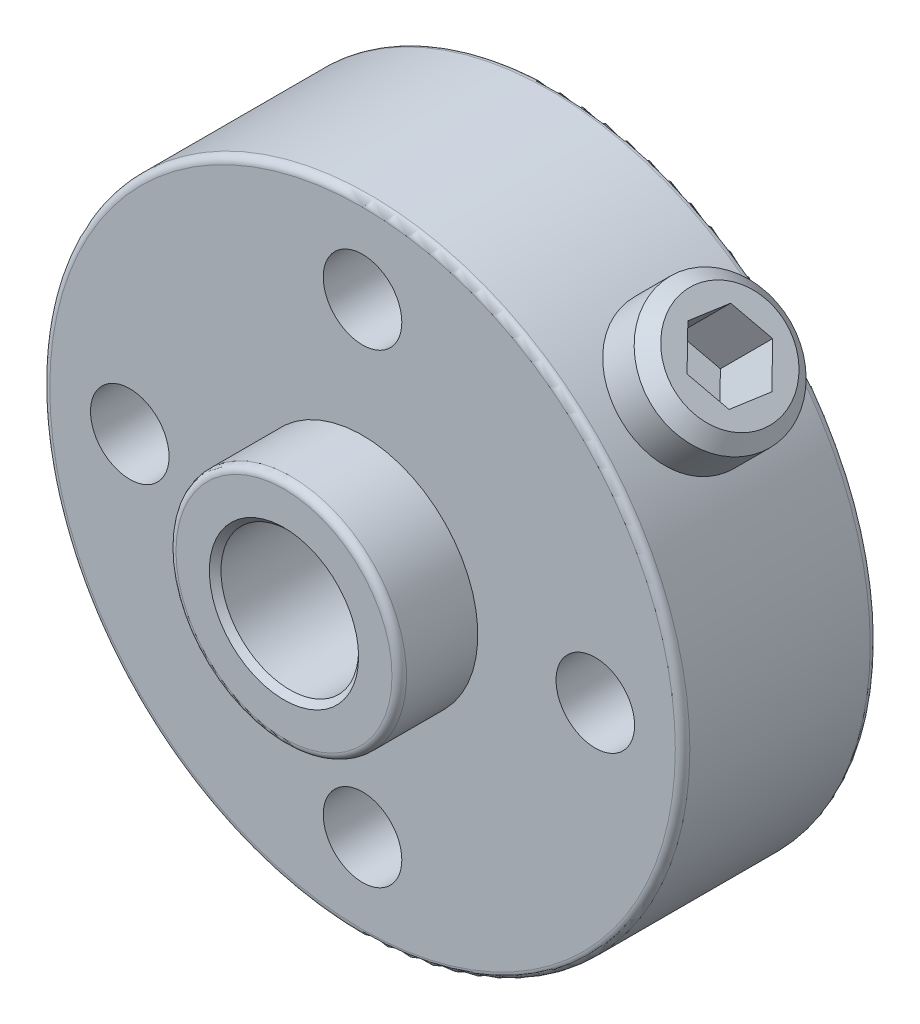
ISO-10303-21;
HEADER;
FILE_DESCRIPTION(('STEP AP214'),'2;1');
FILE_NAME('part.step','',(''),(''),'','','');
FILE_SCHEMA(('AUTOMOTIVE_DESIGN { 1 0 10303 214 1 1 1 1 }'));
ENDSEC;
DATA;
#1=APPLICATION_CONTEXT('core data for automotive mechanical design processes');
#2=APPLICATION_PROTOCOL_DEFINITION('international standard','automotive_design',2000,#1);
#3=PRODUCT_CONTEXT('',#1,'mechanical');
#4=PRODUCT('Part','Part','',(#3));
#5=PRODUCT_RELATED_PRODUCT_CATEGORY('part','',(#4));
#6=PRODUCT_DEFINITION_FORMATION('','',#4);
#7=PRODUCT_DEFINITION_CONTEXT('part definition',#1,'design');
#8=PRODUCT_DEFINITION('design','',#6,#7);
#9=PRODUCT_DEFINITION_SHAPE('','',#8);
#10=(LENGTH_UNIT() NAMED_UNIT(*) SI_UNIT(.MILLI.,.METRE.));
#11=(NAMED_UNIT(*) PLANE_ANGLE_UNIT() SI_UNIT($,.RADIAN.));
#12=(NAMED_UNIT(*) SI_UNIT($,.STERADIAN.) SOLID_ANGLE_UNIT());
#13=UNCERTAINTY_MEASURE_WITH_UNIT(LENGTH_MEASURE(1.E-05),#10,'distance_accuracy_value','');
#14=(GEOMETRIC_REPRESENTATION_CONTEXT(3) GLOBAL_UNCERTAINTY_ASSIGNED_CONTEXT((#13)) GLOBAL_UNIT_ASSIGNED_CONTEXT((#10,
#11,#12)) REPRESENTATION_CONTEXT('',''));
#15=CARTESIAN_POINT('',(0.,0.,0.));
#16=DIRECTION('',(0.,0.,1.));
#17=DIRECTION('',(1.,0.,0.));
#18=AXIS2_PLACEMENT_3D('',#15,#16,#17);
#19=CARTESIAN_POINT('',(0.,0.,2.7));
#20=DIRECTION('',(0.,0.,1.));
#21=DIRECTION('',(1.,0.,0.));
#22=AXIS2_PLACEMENT_3D('',#19,#20,#21);
#23=PLANE('',#22);
#24=CARTESIAN_POINT('',(0.,0.,2.69999999994752));
#25=DIRECTION('',(0.,0.,1.));
#26=DIRECTION('',(1.,0.,0.));
#27=AXIS2_PLACEMENT_3D('',#24,#25,#26);
#28=CIRCLE('',#27,2.56500000000415);
#29=CARTESIAN_POINT('',(2.56500000000415,0.,2.69999999994752));
#30=VERTEX_POINT('',#29);
#31=EDGE_CURVE('P0_E59',#30,#30,#28,.F.);
#32=ORIENTED_EDGE('',*,*,#31,.T.);
#33=EDGE_LOOP('',(#32));
#34=FACE_BOUND('',#33,.T.);
#35=CARTESIAN_POINT('',(0.,0.,2.7));
#36=DIRECTION('',(0.,0.,-1.));
#37=DIRECTION('',(-1.,0.,0.));
#38=AXIS2_PLACEMENT_3D('',#35,#36,#37);
#39=CIRCLE('',#38,3.7125);
#40=CARTESIAN_POINT('',(-3.7125,0.,2.7));
#41=VERTEX_POINT('',#40);
#42=CARTESIAN_POINT('',(3.7125,0.,2.7));
#43=VERTEX_POINT('',#42);
#44=EDGE_CURVE('P0_E53',#41,#43,#39,.T.);
#45=ORIENTED_EDGE('',*,*,#44,.F.);
#46=CARTESIAN_POINT('',(0.,0.,2.7));
#47=DIRECTION('',(0.,0.,-1.));
#48=DIRECTION('',(1.,0.,0.));
#49=AXIS2_PLACEMENT_3D('',#46,#47,#48);
#50=CIRCLE('',#49,3.7125);
#51=EDGE_CURVE('P0_E51',#43,#41,#50,.T.);
#52=ORIENTED_EDGE('',*,*,#51,.F.);
#53=EDGE_LOOP('',(#45,#52));
#54=FACE_BOUND('',#53,.T.);
#55=ADVANCED_FACE('P0_F16',(#34,#54),#23,.T.);
#56=CARTESIAN_POINT('',(0.,0.,2.45));
#57=DIRECTION('',(0.,0.,1.));
#58=DIRECTION('',(1.,0.,0.));
#59=AXIS2_PLACEMENT_3D('',#56,#57,#58);
#60=TOROIDAL_SURFACE('',#59,3.7125,0.25);
#61=ORIENTED_EDGE('',*,*,#51,.T.);
#62=ORIENTED_EDGE('',*,*,#44,.T.);
#63=EDGE_LOOP('',(#61,#62));
#64=FACE_BOUND('',#63,.T.);
#65=CARTESIAN_POINT('',(0.,0.,2.45));
#66=DIRECTION('',(0.,0.,-1.));
#67=DIRECTION('',(-1.,0.,0.));
#68=AXIS2_PLACEMENT_3D('',#65,#66,#67);
#69=CIRCLE('',#68,3.9625);
#70=CARTESIAN_POINT('',(-3.9625,0.,2.45));
#71=VERTEX_POINT('',#70);
#72=EDGE_CURVE('P0_E82',#71,#71,#69,.T.);
#73=ORIENTED_EDGE('',*,*,#72,.F.);
#74=EDGE_LOOP('',(#73));
#75=FACE_BOUND('',#74,.T.);
#76=ADVANCED_FACE('P0_F55',(#64,#75),#60,.T.);
#77=CARTESIAN_POINT('',(11.,11.,-3.5));
#78=DIRECTION('',(-0.707106781186549,-0.707106781186546,0.));
#79=DIRECTION('',(0.707106781186546,-0.707106781186549,0.));
#80=AXIS2_PLACEMENT_3D('',#77,#78,#79);
#81=CYLINDRICAL_SURFACE('',#80,2.);
#82=CARTESIAN_POINT('',(-0.52168205032436,2.30674507442183,-3.49999999999891));
#83=CARTESIAN_POINT('',(-0.521691454806316,2.30674067817891,-3.56896100765012));
#84=CARTESIAN_POINT('',(-0.515061507603195,2.30827067903789,-3.63790693642033));
#85=CARTESIAN_POINT('',(-0.48974675784581,2.31377002769629,-3.77353618507181));
#86=CARTESIAN_POINT('',(-0.4710266110564,2.31774652591454,-3.84021226576348));
#87=CARTESIAN_POINT('',(-0.414560862610267,2.32861912626073,-3.99613388070757));
#88=CARTESIAN_POINT('',(-0.372184943361313,2.33604576066419,-4.08361919139214));
#89=CARTESIAN_POINT('',(-0.27475695560265,2.34950289794732,-4.25139859100648));
#90=CARTESIAN_POINT('',(-0.219662531861126,2.3555285977619,-4.33166737792929));
#91=CARTESIAN_POINT('',(-0.116006471868465,2.36257007688542,-4.46561524917163));
#92=CARTESIAN_POINT('',(-0.0694316735205725,2.36447775375518,-4.52080808227395));
#93=CARTESIAN_POINT('',(0.0276458711251395,2.36533767151401,-4.62765901495117));
#94=CARTESIAN_POINT('',(0.0781504099169405,2.36428855592925,-4.67931548102902));
#95=CARTESIAN_POINT('',(0.234334459406331,2.35566097908678,-4.82889404525901));
#96=CARTESIAN_POINT('',(0.344870209051014,2.34262034929736,-4.92165675794025));
#97=CARTESIAN_POINT('',(0.54901110019452,2.30221544443006,-5.07266534775239));
#98=CARTESIAN_POINT('',(0.641066761462025,2.27858529804084,-5.13402984505323));
#99=CARTESIAN_POINT('',(0.827719529678246,2.21758718367764,-5.24494434080786));
#100=CARTESIAN_POINT('',(0.922312126781514,2.18024226691328,-5.29451393458752));
#101=CARTESIAN_POINT('',(1.09415078845435,2.09843930611568,-5.37175703397063));
#102=CARTESIAN_POINT('',(1.17150303963627,2.05641109357569,-5.40175335858634));
#103=CARTESIAN_POINT('',(1.32346766367267,1.96204896128413,-5.45045251839772));
#104=CARTESIAN_POINT('',(1.39808159543678,1.90972101657789,-5.46916187589072));
#105=CARTESIAN_POINT('',(1.54229480042422,1.79528731871864,-5.49412831238913));
#106=CARTESIAN_POINT('',(1.61187025269642,1.73313904433919,-5.50032954565146));
#107=CARTESIAN_POINT('',(1.7431238659381,1.60106467836018,-5.49964343928243));
#108=CARTESIAN_POINT('',(1.80480261894403,1.53113917057579,-5.49275708147646));
#109=CARTESIAN_POINT('',(1.91436946599737,1.39130857938147,-5.46737644481099));
#110=CARTESIAN_POINT('',(1.96293167246351,1.3217664252004,-5.44975602198832));
#111=CARTESIAN_POINT('',(2.05112573751204,1.18028135848582,-5.40471066580521));
#112=CARTESIAN_POINT('',(2.09075595415579,1.10833800733415,-5.37728393217529));
#113=CARTESIAN_POINT('',(2.16398738546637,0.958084487154221,-5.31130266611804));
#114=CARTESIAN_POINT('',(2.19684052498957,0.879730503956628,-5.27202688338708));
#115=CARTESIAN_POINT('',(2.25287567467671,0.724303710455836,-5.1850017592402));
#116=CARTESIAN_POINT('',(2.27605072021704,0.647231860975414,-5.13724635075155));
#117=CARTESIAN_POINT('',(2.32038618917847,0.469198818045204,-5.01642832081008));
#118=CARTESIAN_POINT('',(2.33796707236794,0.369376284141819,-4.94037415343283));
#119=CARTESIAN_POINT('',(2.36028175156211,0.177759883411549,-4.77700177564113));
#120=CARTESIAN_POINT('',(2.36499956188759,0.0859761437623946,-4.68966969047529));
#121=CARTESIAN_POINT('',(2.36500035642589,-0.069945799764949,-4.52159090060178));
#122=CARTESIAN_POINT('',(2.36187846409729,-0.136047773305256,-4.44265235740094));
#123=CARTESIAN_POINT('',(2.35170750381472,-0.257662011506974,-4.27716305834635));
#124=CARTESIAN_POINT('',(2.34466343397912,-0.313187633234397,-4.19062210838145));
#125=CARTESIAN_POINT('',(2.33212511881827,-0.394442940825091,-4.0360854467395));
#126=CARTESIAN_POINT('',(2.32678908319097,-0.424127543393772,-3.97018002847352));
#127=CARTESIAN_POINT('',(2.31737097601508,-0.472910505235457,-3.83453236649973));
#128=CARTESIAN_POINT('',(2.31328445405078,-0.492046635498725,-3.76480480829779));
#129=CARTESIAN_POINT('',(2.30932059417906,-0.510190150010624,-3.66191875743952));
#130=CARTESIAN_POINT('',(2.30836408070726,-0.514480615694047,-3.62969759613734));
#131=CARTESIAN_POINT('',(2.30707441008557,-0.520230714882549,-3.56499061137247));
#132=CARTESIAN_POINT('',(2.30674127240591,-0.521690259968005,-3.53250477967501));
#133=CARTESIAN_POINT('',(2.30675321163314,-0.521664479749554,-3.43043210057213));
#134=CARTESIAN_POINT('',(2.30830473822011,-0.514923697025169,-3.36077740784869));
#135=CARTESIAN_POINT('',(2.31389821303702,-0.489137925964486,-3.22380260460398));
#136=CARTESIAN_POINT('',(2.31794922837094,-0.470048128277388,-3.15649194068516));
#137=CARTESIAN_POINT('',(2.32897136381334,-0.412624935232888,-2.99939935742625));
#138=CARTESIAN_POINT('',(2.33646239733666,-0.369648889769907,-2.91139531602936));
#139=CARTESIAN_POINT('',(2.3499439342179,-0.271050494159842,-2.74288094066178));
#140=CARTESIAN_POINT('',(2.35593316907542,-0.215417528427273,-2.66237697748713));
#141=CARTESIAN_POINT('',(2.36150709266771,-0.130849273486445,-2.5537827511547));
#142=CARTESIAN_POINT('',(2.36278474548232,-0.105578560039973,-2.52284693352667));
#143=CARTESIAN_POINT('',(2.36453157618707,-0.0537337334216265,-2.46210210072554));
#144=CARTESIAN_POINT('',(2.3650012939713,-0.0271605028650434,-2.43229234611057));
#145=CARTESIAN_POINT('',(2.36499564042404,0.0915076522767793,-2.30435267570849));
#146=CARTESIAN_POINT('',(2.35964476375137,0.189681510653107,-2.21167996007772));
#147=CARTESIAN_POINT('',(2.33405558304133,0.395192126795035,-2.03899803752402));
#148=CARTESIAN_POINT('',(2.31379317340275,0.502543472006744,-1.95900959044929));
#149=CARTESIAN_POINT('',(2.26108786497592,0.69910119126185,-1.82986567034438));
#150=CARTESIAN_POINT('',(2.23215758263383,0.787303496043536,-1.7777715965355));
#151=CARTESIAN_POINT('',(2.1614519208059,0.96457996649776,-1.68518982673315));
#152=CARTESIAN_POINT('',(2.11970206938682,1.05365206185399,-1.64467937074164));
#153=CARTESIAN_POINT('',(2.03000064304302,1.21639110977449,-1.58256600097397));
#154=CARTESIAN_POINT('',(1.98393483034973,1.29035491585882,-1.55903266364001));
#155=CARTESIAN_POINT('',(1.8823615839546,1.43446655545127,-1.52324893275805));
#156=CARTESIAN_POINT('',(1.8268580237278,1.50461593896202,-1.51099392349615));
#157=CARTESIAN_POINT('',(1.70743696869121,1.63889467006043,-1.49856201267063));
#158=CARTESIAN_POINT('',(1.64349771469223,1.70300768836715,-1.49841698290606));
#159=CARTESIAN_POINT('',(1.50932936451131,1.82297889836012,-1.51029550654222));
#160=CARTESIAN_POINT('',(1.43909966810486,1.87883630095751,-1.52232022229155));
#161=CARTESIAN_POINT('',(1.29760552347529,1.97905895940308,-1.5570321564393));
#162=CARTESIAN_POINT('',(1.22648908272564,2.02378836009696,-1.57928376612151));
#163=CARTESIAN_POINT('',(1.08272714162954,2.10421605379406,-1.63310421950918));
#164=CARTESIAN_POINT('',(1.01008093779589,2.13991008895253,-1.66467744082488));
#165=CARTESIAN_POINT('',(0.837823148088682,2.21428545502118,-1.74921286486481));
#166=CARTESIAN_POINT('',(0.738292581316623,2.24908730182021,-1.80575783469752));
#167=CARTESIAN_POINT('',(0.543014410204457,2.30406023818573,-1.93118686798368));
#168=CARTESIAN_POINT('',(0.44727404375807,2.32420450185188,-2.00009326923399));
#169=CARTESIAN_POINT('',(0.260765411264784,2.3525018577989,-2.14949538586543));
#170=CARTESIAN_POINT('',(0.170107975187503,2.36044738464269,-2.23016666699414));
#171=CARTESIAN_POINT('',(-0.00169721109521155,2.36655355087411,-2.4013680472709));
#172=CARTESIAN_POINT('',(-0.0828491975393915,2.36471856617266,-2.49189371969741));
#173=CARTESIAN_POINT('',(-0.212235807558901,2.35610650847235,-2.65848363768951));
#174=CARTESIAN_POINT('',(-0.263553673728961,2.35073162182008,-2.73222583080744));
#175=CARTESIAN_POINT('',(-0.355767828890062,2.33854773585189,-2.88597155429135));
#176=CARTESIAN_POINT('',(-0.39667269406354,2.33173992519515,-2.96596986064457));
#177=CARTESIAN_POINT('',(-0.458798372171096,2.32025822100382,-3.1207740051491));
#178=CARTESIAN_POINT('',(-0.481963340483448,2.31541929350727,-3.19475923446323));
#179=CARTESIAN_POINT('',(-0.513368922126983,2.30867126032279,-3.3458454688067));
#180=CARTESIAN_POINT('',(-0.521671540280741,2.3067499874734,-3.4229321506619));
#181=CARTESIAN_POINT('',(-0.52168205032436,2.30674507442183,-3.49999999999891));
#182=B_SPLINE_CURVE_WITH_KNOTS('',3,(#82,#83,#84,#85,#86,#87,#88,#89,#90,#91,#92,#93,#94,#95,
#96,#97,#98,#99,#100,#101,#102,#103,#104,#105,#106,#107,#108,#109,#110,#111,#112,#113,#114,#115,
#116,#117,#118,#119,#120,#121,#122,#123,#124,#125,#126,#127,#128,#129,#130,#131,#132,#133,#134,
#135,#136,#137,#138,#139,#140,#141,#142,#143,#144,#145,#146,#147,#148,#149,#150,#151,#152,#153,
#154,#155,#156,#157,#158,#159,#160,#161,#162,#163,#164,#165,#166,#167,#168,#169,#170,#171,#172,
#173,#174,#175,#176,#177,#178,#179,#180,#181),.UNSPECIFIED.,.T.,.F.,(4,2,2,2,2,2,2,2,2,2,2,2,2,
2,2,2,2,2,2,2,2,2,2,2,2,2,2,2,2,2,2,2,2,2,2,2,2,2,2,2,2,2,2,2,2,2,2,2,2,4),(0.,
0.206566278439336,0.413739178684212,0.704581330275758,0.996406386712573,1.21287408618639,
1.42944110969548,1.861693263469,2.19989096278798,2.53752281586716,2.81538006534249,
3.09307659778692,3.3720102576619,3.65092299288104,3.90970117980148,4.16852689834573,
4.44831151466985,4.72829712621299,5.1068210589018,5.48581519105835,5.79414546175733,
6.10208371658079,6.31889757596602,6.53492996008108,6.63237249082537,6.72981806499419,
6.93837459026248,7.14769215632039,7.44071455526376,7.7339836293227,7.85384538904754,
7.97362702124969,8.37718861961784,8.7814040423713,9.09954319796718,9.41705289571404,
9.68666314419226,9.95616300415526,10.2263721283555,10.4966070630249,10.7562683274247,
11.0160517283024,11.3730378661574,11.730675717949,12.0943339749051,12.4578295407266,
12.7272357155942,12.996419283486,13.228238260295,13.4590878282912),.UNSPECIFIED.);
#183=CARTESIAN_POINT('',(-0.52168205032436,2.30674507442183,-3.49999999999891));
#184=VERTEX_POINT('',#183);
#185=EDGE_CURVE('P0_E129',#184,#184,#182,.T.);
#186=ORIENTED_EDGE('',*,*,#185,.T.);
#187=EDGE_LOOP('',(#186));
#188=FACE_BOUND('',#187,.T.);
#189=CARTESIAN_POINT('',(9.06274283276228,6.23431570801607,-3.5));
#190=CARTESIAN_POINT('',(9.06274088204533,6.23432115195091,-3.38877192154164));
#191=CARTESIAN_POINT('',(9.05738109444068,6.24213227814095,-3.27740346116536));
#192=CARTESIAN_POINT('',(9.03598043120289,6.27306922423071,-3.05771646567499));
#193=CARTESIAN_POINT('',(9.01991807135712,6.29622584798402,-2.94940452295279));
#194=CARTESIAN_POINT('',(8.97731495493593,6.35682135110159,-2.73916916786081));
#195=CARTESIAN_POINT('',(8.9507882823007,6.39424103151245,-2.6372373812038));
#196=CARTESIAN_POINT('',(8.88758578410295,6.48179914692091,-2.4424446268986));
#197=CARTESIAN_POINT('',(8.85091352753535,6.53193310879613,-2.34958048496468));
#198=CARTESIAN_POINT('',(8.76743221647635,6.64357042991639,-2.17441912774592));
#199=CARTESIAN_POINT('',(8.72051986878099,6.70518863168243,-2.09224430740208));
#200=CARTESIAN_POINT('',(8.61745270660398,6.83714155855808,-1.941857946148));
#201=CARTESIAN_POINT('',(8.56129682011116,6.90747729444195,-1.87364802686589));
#202=CARTESIAN_POINT('',(8.44024241066525,7.05488869561823,-1.75267243645868));
#203=CARTESIAN_POINT('',(8.37528444084824,7.13200881687022,-1.70002028148271));
#204=CARTESIAN_POINT('',(8.23824348846784,7.28987350641371,-1.61238636115904));
#205=CARTESIAN_POINT('',(8.16616111842381,7.37061776279541,-1.57740307830977));
#206=CARTESIAN_POINT('',(8.01739873708996,7.53214681210441,-1.52647278856437));
#207=CARTESIAN_POINT('',(7.94077765113772,7.61292149777965,-1.51032171154278));
#208=CARTESIAN_POINT('',(7.78428220288076,7.7728671589118,-1.49687882847371));
#209=CARTESIAN_POINT('',(7.70440809698726,7.85203826003354,-1.49958553885721));
#210=CARTESIAN_POINT('',(7.5447122818131,8.00558858736264,-1.52362409272648));
#211=CARTESIAN_POINT('',(7.46490104694763,8.08001328763645,-1.54473607844976));
#212=CARTESIAN_POINT('',(7.30686024459693,8.22320934923674,-1.60463889773854));
#213=CARTESIAN_POINT('',(7.22863074481126,8.29198046896996,-1.64343048633977));
#214=CARTESIAN_POINT('',(7.07586827871794,8.42272288145919,-1.7378048188959));
#215=CARTESIAN_POINT('',(7.00135745557928,8.48465561470768,-1.79347674584562));
#216=CARTESIAN_POINT('',(6.85900228197869,8.60014546558179,-1.91996137070917));
#217=CARTESIAN_POINT('',(6.79115806733556,8.65370241258067,-1.99077437699887));
#218=CARTESIAN_POINT('',(6.66361475848494,8.75230487978952,-2.14673097909815));
#219=CARTESIAN_POINT('',(6.60404544438873,8.79721830097002,-2.23206432757659));
#220=CARTESIAN_POINT('',(6.49646320525821,8.87696267398164,-2.4140536172622));
#221=CARTESIAN_POINT('',(6.44845545045247,8.91178911640943,-2.51071459546905));
#222=CARTESIAN_POINT('',(6.36588485250253,8.97095906903446,-2.71287867435533));
#223=CARTESIAN_POINT('',(6.33135338066569,8.9952781331269,-2.81840171979615));
#224=CARTESIAN_POINT('',(6.27745119543539,9.03297877327253,-3.03496478413665));
#225=CARTESIAN_POINT('',(6.25804848636304,9.04638343476674,-3.14599262878978));
#226=CARTESIAN_POINT('',(6.24251884871756,9.05709512030643,-3.29820247488302));
#227=CARTESIAN_POINT('',(6.23944591375329,9.05921194508786,-3.3384662035654));
#228=CARTESIAN_POINT('',(6.23534335252788,9.06203615681651,-3.41914710371802));
#229=CARTESIAN_POINT('',(6.23431372893444,9.0627435419236,-3.45956427538853));
#230=CARTESIAN_POINT('',(6.23432115195094,9.06274088204531,-3.61122807845836));
#231=CARTESIAN_POINT('',(6.24213227814098,9.05738109444066,-3.72259653883464));
#232=CARTESIAN_POINT('',(6.27306922423074,9.03598043120287,-3.94228353432501));
#233=CARTESIAN_POINT('',(6.29622584798405,9.0199180713571,-4.05059547704721));
#234=CARTESIAN_POINT('',(6.35682135110162,8.97731495493591,-4.26083083213919));
#235=CARTESIAN_POINT('',(6.39424103151248,8.95078828230068,-4.3627626187962));
#236=CARTESIAN_POINT('',(6.48179914692094,8.88758578410293,-4.5575553731014));
#237=CARTESIAN_POINT('',(6.53193310879616,8.85091352753533,-4.65041951503532));
#238=CARTESIAN_POINT('',(6.64357042991642,8.76743221647633,-4.82558087225408));
#239=CARTESIAN_POINT('',(6.70518863168246,8.72051986878097,-4.90775569259792));
#240=CARTESIAN_POINT('',(6.83714155855811,8.61745270660396,-5.058142053852));
#241=CARTESIAN_POINT('',(6.90747729444198,8.56129682011114,-5.12635197313411));
#242=CARTESIAN_POINT('',(7.05488869561826,8.44024241066523,-5.24732756354132));
#243=CARTESIAN_POINT('',(7.13200881687025,8.37528444084822,-5.29997971851729));
#244=CARTESIAN_POINT('',(7.28987350641374,8.23824348846782,-5.38761363884096));
#245=CARTESIAN_POINT('',(7.37061776279544,8.16616111842379,-5.42259692169023));
#246=CARTESIAN_POINT('',(7.53214681210443,8.01739873708994,-5.47352721143563));
#247=CARTESIAN_POINT('',(7.61292149777967,7.9407776511377,-5.48967828845722));
#248=CARTESIAN_POINT('',(7.77286715891182,7.78428220288074,-5.50312117152629));
#249=CARTESIAN_POINT('',(7.85203826003356,7.70440809698723,-5.50041446114279));
#250=CARTESIAN_POINT('',(8.00558858736267,7.54471228181307,-5.47637590727352));
#251=CARTESIAN_POINT('',(8.08001328763647,7.46490104694761,-5.45526392155024));
#252=CARTESIAN_POINT('',(8.22320934923677,7.30686024459691,-5.39536110226147));
#253=CARTESIAN_POINT('',(8.29198046896998,7.22863074481123,-5.35656951366023));
#254=CARTESIAN_POINT('',(8.42272288145921,7.07586827871791,-5.26219518110411));
#255=CARTESIAN_POINT('',(8.4846556147077,7.00135745557926,-5.20652325415439));
#256=CARTESIAN_POINT('',(8.60014546558181,6.85900228197867,-5.08003862929083));
#257=CARTESIAN_POINT('',(8.6537024125807,6.79115806733553,-5.00922562300113));
#258=CARTESIAN_POINT('',(8.75230487978954,6.66361475848491,-4.85326902090185));
#259=CARTESIAN_POINT('',(8.79721830097004,6.60404544438871,-4.76793567242341));
#260=CARTESIAN_POINT('',(8.87696267398166,6.49646320525818,-4.5859463827378));
#261=CARTESIAN_POINT('',(8.91178911640945,6.44845545045244,-4.48928540453095));
#262=CARTESIAN_POINT('',(8.97095906903448,6.3658848525025,-4.28712132564468));
#263=CARTESIAN_POINT('',(8.99527813312692,6.33135338066566,-4.18159828020385));
#264=CARTESIAN_POINT('',(9.03297877327255,6.27745119543536,-3.96503521586336));
#265=CARTESIAN_POINT('',(9.04638343476676,6.25804848636301,-3.85400737121022));
#266=CARTESIAN_POINT('',(9.05709512030645,6.24251884871753,-3.70179752511698));
#267=CARTESIAN_POINT('',(9.05921194508788,6.23944591375326,-3.6615337964346));
#268=CARTESIAN_POINT('',(9.06203615681653,6.23534335252785,-3.58085289628198));
#269=CARTESIAN_POINT('',(9.06274354192362,6.23431372893441,-3.54043572461147));
#270=CARTESIAN_POINT('',(9.06274283276228,6.23431570801607,-3.5));
#271=B_SPLINE_CURVE_WITH_KNOTS('',3,(#189,#190,#191,#192,#193,#194,#195,#196,#197,#198,#199,
#200,#201,#202,#203,#204,#205,#206,#207,#208,#209,#210,#211,#212,#213,#214,#215,#216,#217,#218,
#219,#220,#221,#222,#223,#224,#225,#226,#227,#228,#229,#230,#231,#232,#233,#234,#235,#236,#237,
#238,#239,#240,#241,#242,#243,#244,#245,#246,#247,#248,#249,#250,#251,#252,#253,#254,#255,#256,
#257,#258,#259,#260,#261,#262,#263,#264,#265,#266,#267,#268,#269,#270),.UNSPECIFIED.,.T.,.F.,(4,
2,2,2,2,2,2,2,2,2,2,2,2,2,2,2,2,2,2,2,2,2,2,2,2,2,2,2,2,2,2,2,2,2,2,2,2,2,2,2,4),(0.,
0.333529688793996,0.667730926206845,1.00148388777621,1.33511959130182,1.67229053719327,
2.00950061377132,2.34911358250473,2.68869737841486,3.02456612403384,3.36040844667843,
3.69229314349858,4.02419201531445,4.35787588235592,4.69156654612926,5.03001016723487,
5.36860485750273,5.70798312326136,6.04664167949508,6.16789251134449,6.28914350149688,
6.62267319029088,6.95687442770373,7.29062738927309,7.62426309279871,7.96143403869015,
8.29864411526821,8.63825708400161,8.97784087991175,9.31370962553072,9.64955194817531,
9.98143664499546,10.3133355168113,10.6470193838528,10.9807100476261,11.3191536687318,
11.6577483589996,11.9971266247582,12.335785180992,12.4570360128414,12.5782870029938),.UNSPECIFIED.);
#272=CARTESIAN_POINT('',(9.06274283276228,6.23431570801607,-3.5));
#273=VERTEX_POINT('',#272);
#274=EDGE_CURVE('P0_E138',#273,#273,#271,.T.);
#275=ORIENTED_EDGE('',*,*,#274,.F.);
#276=EDGE_LOOP('',(#275));
#277=FACE_BOUND('',#276,.T.);
#278=ADVANCED_FACE('P0_F87',(#188,#277),#81,.F.);
#279=CARTESIAN_POINT('',(0.,0.,2.69999999994752));
#280=DIRECTION('',(0.,0.,1.));
#281=DIRECTION('',(1.,0.,0.));
#282=AXIS2_PLACEMENT_3D('',#279,#280,#281);
#283=CONICAL_SURFACE('',#282,2.56500000000415,0.785398163397448);
#284=ORIENTED_EDGE('',*,*,#31,.F.);
#285=EDGE_LOOP('',(#284));
#286=FACE_BOUND('',#285,.T.);
#287=CARTESIAN_POINT('',(0.,0.,2.5));
#288=DIRECTION('',(0.,0.,1.));
#289=DIRECTION('',(1.,0.,0.));
#290=AXIS2_PLACEMENT_3D('',#287,#288,#289);
#291=CIRCLE('',#290,2.365);
#292=CARTESIAN_POINT('',(2.365,0.,2.5));
#293=VERTEX_POINT('',#292);
#294=EDGE_CURVE('P0_E136',#293,#293,#291,.F.);
#295=ORIENTED_EDGE('',*,*,#294,.T.);
#296=EDGE_LOOP('',(#295));
#297=FACE_BOUND('',#296,.T.);
#298=ADVANCED_FACE('P0_F164',(#286,#297),#283,.F.);
#299=CARTESIAN_POINT('',(0.,0.,-0.25));
#300=DIRECTION('',(0.,0.,1.));
#301=DIRECTION('',(1.,0.,0.));
#302=AXIS2_PLACEMENT_3D('',#299,#300,#301);
#303=TOROIDAL_SURFACE('',#302,10.75,0.25);
#304=CARTESIAN_POINT('',(0.,0.,-0.25));
#305=DIRECTION('',(0.,0.,1.));
#306=DIRECTION('',(1.,0.,0.));
#307=AXIS2_PLACEMENT_3D('',#304,#305,#306);
#308=CIRCLE('',#307,11.);
#309=CARTESIAN_POINT('',(11.,0.,-0.25));
#310=VERTEX_POINT('',#309);
#311=EDGE_CURVE('P0_E137',#310,#310,#308,.F.);
#312=ORIENTED_EDGE('',*,*,#311,.F.);
#313=EDGE_LOOP('',(#312));
#314=FACE_BOUND('',#313,.T.);
#315=CARTESIAN_POINT('',(0.,0.,0.));
#316=DIRECTION('',(0.,0.,-1.));
#317=DIRECTION('',(1.,0.,0.));
#318=AXIS2_PLACEMENT_3D('',#315,#316,#317);
#319=CIRCLE('',#318,10.75);
#320=CARTESIAN_POINT('',(-10.75,0.,0.));
#321=VERTEX_POINT('',#320);
#322=CARTESIAN_POINT('',(10.75,0.,0.));
#323=VERTEX_POINT('',#322);
#324=EDGE_CURVE('P0_E128',#321,#323,#319,.F.);
#325=ORIENTED_EDGE('',*,*,#324,.F.);
#326=CARTESIAN_POINT('',(0.,0.,0.));
#327=DIRECTION('',(0.,0.,-1.));
#328=DIRECTION('',(-1.,0.,0.));
#329=AXIS2_PLACEMENT_3D('',#326,#327,#328);
#330=CIRCLE('',#329,10.75);
#331=EDGE_CURVE('P0_E185',#323,#321,#330,.F.);
#332=ORIENTED_EDGE('',*,*,#331,.F.);
#333=EDGE_LOOP('',(#325,#332));
#334=FACE_BOUND('',#333,.T.);
#335=ADVANCED_FACE('P0_F159',(#314,#334),#303,.T.);
#336=CARTESIAN_POINT('',(0.,0.,2.7));
#337=DIRECTION('',(0.,0.,-1.));
#338=DIRECTION('',(-1.,0.,0.));
#339=AXIS2_PLACEMENT_3D('',#336,#337,#338);
#340=CYLINDRICAL_SURFACE('',#339,3.9625);
#341=CARTESIAN_POINT('',(0.,0.,0.));
#342=DIRECTION('',(0.,0.,-1.));
#343=DIRECTION('',(-1.,0.,0.));
#344=AXIS2_PLACEMENT_3D('',#341,#342,#343);
#345=CIRCLE('',#344,3.9625);
#346=CARTESIAN_POINT('',(-3.9625,0.,0.));
#347=VERTEX_POINT('',#346);
#348=EDGE_CURVE('P0_E124',#347,#347,#345,.T.);
#349=ORIENTED_EDGE('',*,*,#348,.F.);
#350=EDGE_LOOP('',(#349));
#351=FACE_BOUND('',#350,.T.);
#352=ORIENTED_EDGE('',*,*,#72,.T.);
#353=EDGE_LOOP('',(#352));
#354=FACE_BOUND('',#353,.T.);
#355=ADVANCED_FACE('P0_F155',(#351,#354),#340,.T.);
#356=CARTESIAN_POINT('',(0.,0.,-6.7));
#357=DIRECTION('',(0.,0.,1.));
#358=DIRECTION('',(1.,0.,0.));
#359=AXIS2_PLACEMENT_3D('',#356,#357,#358);
#360=CYLINDRICAL_SURFACE('',#359,11.);
#361=CARTESIAN_POINT('',(0.,0.,-6.45));
#362=DIRECTION('',(0.,0.,1.));
#363=DIRECTION('',(1.,0.,0.));
#364=AXIS2_PLACEMENT_3D('',#361,#362,#363);
#365=CIRCLE('',#364,11.);
#366=CARTESIAN_POINT('',(11.,0.,-6.45));
#367=VERTEX_POINT('',#366);
#368=EDGE_CURVE('P0_E127',#367,#367,#365,.F.);
#369=ORIENTED_EDGE('',*,*,#368,.F.);
#370=EDGE_LOOP('',(#369));
#371=FACE_BOUND('',#370,.T.);
#372=ORIENTED_EDGE('',*,*,#311,.T.);
#373=EDGE_LOOP('',(#372));
#374=FACE_BOUND('',#373,.T.);
#375=ORIENTED_EDGE('',*,*,#274,.T.);
#376=EDGE_LOOP('',(#375));
#377=FACE_BOUND('',#376,.T.);
#378=ADVANCED_FACE('P0_F148',(#371,#374,#377),#360,.T.);
#379=CARTESIAN_POINT('',(0.,0.,-6.7));
#380=DIRECTION('',(0.,0.,1.));
#381=DIRECTION('',(1.,0.,0.));
#382=AXIS2_PLACEMENT_3D('',#379,#380,#381);
#383=CYLINDRICAL_SURFACE('',#382,2.365);
#384=ORIENTED_EDGE('',*,*,#185,.F.);
#385=EDGE_LOOP('',(#384));
#386=FACE_BOUND('',#385,.T.);
#387=ORIENTED_EDGE('',*,*,#294,.F.);
#388=EDGE_LOOP('',(#387));
#389=FACE_BOUND('',#388,.T.);
#390=CARTESIAN_POINT('',(0.,0.,-6.49999999995998));
#391=DIRECTION('',(0.,0.,-1.));
#392=DIRECTION('',(-1.,0.,0.));
#393=AXIS2_PLACEMENT_3D('',#390,#391,#392);
#394=CIRCLE('',#393,2.36499999999751);
#395=CARTESIAN_POINT('',(-2.36499999999751,0.,-6.49999999995998));
#396=VERTEX_POINT('',#395);
#397=EDGE_CURVE('P0_E123',#396,#396,#394,.T.);
#398=ORIENTED_EDGE('',*,*,#397,.T.);
#399=EDGE_LOOP('',(#398));
#400=FACE_BOUND('',#399,.T.);
#401=ADVANCED_FACE('P0_F143',(#386,#389,#400),#383,.F.);
#402=CARTESIAN_POINT('',(0.,0.,0.));
#403=DIRECTION('',(0.,0.,1.));
#404=DIRECTION('',(1.,0.,0.));
#405=AXIS2_PLACEMENT_3D('',#402,#403,#404);
#406=PLANE('',#405);
#407=ORIENTED_EDGE('',*,*,#348,.T.);
#408=EDGE_LOOP('',(#407));
#409=FACE_BOUND('',#408,.T.);
#410=CARTESIAN_POINT('',(0.,8.,0.));
#411=DIRECTION('',(0.,0.,1.));
#412=DIRECTION('',(1.,0.,0.));
#413=AXIS2_PLACEMENT_3D('',#410,#411,#412);
#414=CIRCLE('',#413,1.35);
#415=CARTESIAN_POINT('',(1.35,8.,0.));
#416=VERTEX_POINT('',#415);
#417=EDGE_CURVE('P0_E110',#416,#416,#414,.F.);
#418=ORIENTED_EDGE('',*,*,#417,.T.);
#419=EDGE_LOOP('',(#418));
#420=FACE_BOUND('',#419,.T.);
#421=CARTESIAN_POINT('',(8.,0.,0.));
#422=DIRECTION('',(0.,0.,1.));
#423=DIRECTION('',(1.,0.,0.));
#424=AXIS2_PLACEMENT_3D('',#421,#422,#423);
#425=CIRCLE('',#424,1.35);
#426=CARTESIAN_POINT('',(9.35,0.,0.));
#427=VERTEX_POINT('',#426);
#428=EDGE_CURVE('P0_E114',#427,#427,#425,.F.);
#429=ORIENTED_EDGE('',*,*,#428,.T.);
#430=EDGE_LOOP('',(#429));
#431=FACE_BOUND('',#430,.T.);
#432=CARTESIAN_POINT('',(0.,-8.,0.));
#433=DIRECTION('',(0.,0.,1.));
#434=DIRECTION('',(1.,0.,0.));
#435=AXIS2_PLACEMENT_3D('',#432,#433,#434);
#436=CIRCLE('',#435,1.35);
#437=CARTESIAN_POINT('',(1.35,-8.,0.));
#438=VERTEX_POINT('',#437);
#439=EDGE_CURVE('P0_E117',#438,#438,#436,.F.);
#440=ORIENTED_EDGE('',*,*,#439,.T.);
#441=EDGE_LOOP('',(#440));
#442=FACE_BOUND('',#441,.T.);
#443=CARTESIAN_POINT('',(-8.,0.,0.));
#444=DIRECTION('',(0.,0.,1.));
#445=DIRECTION('',(1.,0.,0.));
#446=AXIS2_PLACEMENT_3D('',#443,#444,#445);
#447=CIRCLE('',#446,1.35);
#448=CARTESIAN_POINT('',(-6.65,0.,0.));
#449=VERTEX_POINT('',#448);
#450=EDGE_CURVE('P0_E120',#449,#449,#447,.F.);
#451=ORIENTED_EDGE('',*,*,#450,.T.);
#452=EDGE_LOOP('',(#451));
#453=FACE_BOUND('',#452,.T.);
#454=ORIENTED_EDGE('',*,*,#331,.T.);
#455=ORIENTED_EDGE('',*,*,#324,.T.);
#456=EDGE_LOOP('',(#454,#455));
#457=FACE_BOUND('',#456,.T.);
#458=ADVANCED_FACE('P0_F147',(#409,#420,#431,#442,#453,#457),#406,.T.);
#459=CARTESIAN_POINT('',(0.,0.,-6.45));
#460=DIRECTION('',(0.,0.,1.));
#461=DIRECTION('',(1.,0.,0.));
#462=AXIS2_PLACEMENT_3D('',#459,#460,#461);
#463=TOROIDAL_SURFACE('',#462,10.75,0.25);
#464=CARTESIAN_POINT('',(0.,0.,-6.7));
#465=DIRECTION('',(0.,0.,1.));
#466=DIRECTION('',(1.,0.,0.));
#467=AXIS2_PLACEMENT_3D('',#464,#465,#466);
#468=CIRCLE('',#467,10.75);
#469=CARTESIAN_POINT('',(10.75,0.,-6.7));
#470=VERTEX_POINT('',#469);
#471=CARTESIAN_POINT('',(-10.75,0.,-6.7));
#472=VERTEX_POINT('',#471);
#473=EDGE_CURVE('P0_E113',#470,#472,#468,.T.);
#474=ORIENTED_EDGE('',*,*,#473,.T.);
#475=CARTESIAN_POINT('',(0.,0.,-6.7));
#476=DIRECTION('',(0.,0.,1.));
#477=DIRECTION('',(-1.,0.,0.));
#478=AXIS2_PLACEMENT_3D('',#475,#476,#477);
#479=CIRCLE('',#478,10.75);
#480=EDGE_CURVE('P0_E36',#472,#470,#479,.T.);
#481=ORIENTED_EDGE('',*,*,#480,.T.);
#482=EDGE_LOOP('',(#474,#481));
#483=FACE_BOUND('',#482,.T.);
#484=ORIENTED_EDGE('',*,*,#368,.T.);
#485=EDGE_LOOP('',(#484));
#486=FACE_BOUND('',#485,.T.);
#487=ADVANCED_FACE('P0_F208',(#483,#486),#463,.T.);
#488=CARTESIAN_POINT('',(0.,0.,-6.70000000002346));
#489=DIRECTION('',(0.,0.,-1.));
#490=DIRECTION('',(0.,1.,0.));
#491=AXIS2_PLACEMENT_3D('',#488,#489,#490);
#492=CONICAL_SURFACE('',#491,2.56500000000415,0.78539816325534);
#493=CARTESIAN_POINT('',(0.,0.,-6.70000000002346));
#494=DIRECTION('',(0.,0.,-1.));
#495=DIRECTION('',(0.,1.,0.));
#496=AXIS2_PLACEMENT_3D('',#493,#494,#495);
#497=CIRCLE('',#496,2.56500000000415);
#498=CARTESIAN_POINT('',(0.,2.56500000000415,-6.70000000002346));
#499=VERTEX_POINT('',#498);
#500=EDGE_CURVE('P0_E107',#499,#499,#497,.T.);
#501=ORIENTED_EDGE('',*,*,#500,.T.);
#502=EDGE_LOOP('',(#501));
#503=FACE_BOUND('',#502,.T.);
#504=ORIENTED_EDGE('',*,*,#397,.F.);
#505=EDGE_LOOP('',(#504));
#506=FACE_BOUND('',#505,.T.);
#507=ADVANCED_FACE('P0_F218',(#503,#506),#492,.F.);
#508=CARTESIAN_POINT('',(-8.,0.,-6.7));
#509=DIRECTION('',(0.,0.,1.));
#510=DIRECTION('',(1.,0.,0.));
#511=AXIS2_PLACEMENT_3D('',#508,#509,#510);
#512=CYLINDRICAL_SURFACE('',#511,1.35);
#513=CARTESIAN_POINT('',(-8.,0.,-6.7));
#514=DIRECTION('',(0.,0.,1.));
#515=DIRECTION('',(1.,0.,0.));
#516=AXIS2_PLACEMENT_3D('',#513,#514,#515);
#517=CIRCLE('',#516,1.35);
#518=CARTESIAN_POINT('',(-6.65,0.,-6.7));
#519=VERTEX_POINT('',#518);
#520=EDGE_CURVE('P0_E104',#519,#519,#517,.F.);
#521=ORIENTED_EDGE('',*,*,#520,.T.);
#522=EDGE_LOOP('',(#521));
#523=FACE_BOUND('',#522,.T.);
#524=ORIENTED_EDGE('',*,*,#450,.F.);
#525=EDGE_LOOP('',(#524));
#526=FACE_BOUND('',#525,.T.);
#527=ADVANCED_FACE('P0_F262',(#523,#526),#512,.F.);
#528=CARTESIAN_POINT('',(0.,-8.,-6.7));
#529=DIRECTION('',(0.,0.,1.));
#530=DIRECTION('',(1.,0.,0.));
#531=AXIS2_PLACEMENT_3D('',#528,#529,#530);
#532=CYLINDRICAL_SURFACE('',#531,1.35);
#533=CARTESIAN_POINT('',(0.,-8.,-6.7));
#534=DIRECTION('',(0.,0.,1.));
#535=DIRECTION('',(1.,0.,0.));
#536=AXIS2_PLACEMENT_3D('',#533,#534,#535);
#537=CIRCLE('',#536,1.35);
#538=CARTESIAN_POINT('',(1.35,-8.,-6.7));
#539=VERTEX_POINT('',#538);
#540=EDGE_CURVE('P0_E101',#539,#539,#537,.F.);
#541=ORIENTED_EDGE('',*,*,#540,.T.);
#542=EDGE_LOOP('',(#541));
#543=FACE_BOUND('',#542,.T.);
#544=ORIENTED_EDGE('',*,*,#439,.F.);
#545=EDGE_LOOP('',(#544));
#546=FACE_BOUND('',#545,.T.);
#547=ADVANCED_FACE('P0_F268',(#543,#546),#532,.F.);
#548=CARTESIAN_POINT('',(8.,0.,-6.7));
#549=DIRECTION('',(0.,0.,1.));
#550=DIRECTION('',(1.,0.,0.));
#551=AXIS2_PLACEMENT_3D('',#548,#549,#550);
#552=CYLINDRICAL_SURFACE('',#551,1.35);
#553=CARTESIAN_POINT('',(8.,0.,-6.7));
#554=DIRECTION('',(0.,0.,1.));
#555=DIRECTION('',(1.,0.,0.));
#556=AXIS2_PLACEMENT_3D('',#553,#554,#555);
#557=CIRCLE('',#556,1.35);
#558=CARTESIAN_POINT('',(9.35,0.,-6.7));
#559=VERTEX_POINT('',#558);
#560=EDGE_CURVE('P0_E28',#559,#559,#557,.F.);
#561=ORIENTED_EDGE('',*,*,#560,.T.);
#562=EDGE_LOOP('',(#561));
#563=FACE_BOUND('',#562,.T.);
#564=ORIENTED_EDGE('',*,*,#428,.F.);
#565=EDGE_LOOP('',(#564));
#566=FACE_BOUND('',#565,.T.);
#567=ADVANCED_FACE('P0_F277',(#563,#566),#552,.F.);
#568=CARTESIAN_POINT('',(0.,8.,-6.7));
#569=DIRECTION('',(0.,0.,1.));
#570=DIRECTION('',(1.,0.,0.));
#571=AXIS2_PLACEMENT_3D('',#568,#569,#570);
#572=CYLINDRICAL_SURFACE('',#571,1.35);
#573=CARTESIAN_POINT('',(0.,8.,-6.7));
#574=DIRECTION('',(0.,0.,1.));
#575=DIRECTION('',(1.,0.,0.));
#576=AXIS2_PLACEMENT_3D('',#573,#574,#575);
#577=CIRCLE('',#576,1.35);
#578=CARTESIAN_POINT('',(1.35,8.,-6.7));
#579=VERTEX_POINT('',#578);
#580=EDGE_CURVE('P0_E10',#579,#579,#577,.F.);
#581=ORIENTED_EDGE('',*,*,#580,.T.);
#582=EDGE_LOOP('',(#581));
#583=FACE_BOUND('',#582,.T.);
#584=ORIENTED_EDGE('',*,*,#417,.F.);
#585=EDGE_LOOP('',(#584));
#586=FACE_BOUND('',#585,.T.);
#587=ADVANCED_FACE('P0_F272',(#583,#586),#572,.F.);
#588=CARTESIAN_POINT('',(0.,0.,-6.7));
#589=DIRECTION('',(0.,0.,1.));
#590=DIRECTION('',(1.,0.,0.));
#591=AXIS2_PLACEMENT_3D('',#588,#589,#590);
#592=PLANE('',#591);
#593=ORIENTED_EDGE('',*,*,#580,.F.);
#594=EDGE_LOOP('',(#593));
#595=FACE_BOUND('',#594,.T.);
#596=ORIENTED_EDGE('',*,*,#560,.F.);
#597=EDGE_LOOP('',(#596));
#598=FACE_BOUND('',#597,.T.);
#599=ORIENTED_EDGE('',*,*,#540,.F.);
#600=EDGE_LOOP('',(#599));
#601=FACE_BOUND('',#600,.T.);
#602=ORIENTED_EDGE('',*,*,#520,.F.);
#603=EDGE_LOOP('',(#602));
#604=FACE_BOUND('',#603,.T.);
#605=ORIENTED_EDGE('',*,*,#500,.F.);
#606=EDGE_LOOP('',(#605));
#607=FACE_BOUND('',#606,.T.);
#608=ORIENTED_EDGE('',*,*,#473,.F.);
#609=ORIENTED_EDGE('',*,*,#480,.F.);
#610=EDGE_LOOP('',(#608,#609));
#611=FACE_BOUND('',#610,.T.);
#612=ADVANCED_FACE('P0_F270',(#595,#598,#601,#604,#607,#611),#592,.F.);
#613=CLOSED_SHELL('',(#55,#76,#278,#298,#335,#355,#378,#401,#458,#487,#507,#527,#547,#567,#587,#612));
#614=MANIFOLD_SOLID_BREP('P0_B1',#613);
#615=CARTESIAN_POINT('',(6.43994301090835,8.21777613106688,-2.94524212617848));
#616=DIRECTION('',(-0.417506201609009,0.41750620160901,0.807079390912712));
#617=DIRECTION('',(0.,-0.888194584355134,0.459467496480667));
#618=AXIS2_PLACEMENT_3D('',#615,#616,#617);
#619=PLANE('',#618);
#620=DIRECTION('',(0.707106781186548,0.707106781186547,0.));
#621=VECTOR('',#620,1.);
#622=CARTESIAN_POINT('',(7.2241197213615,7.43359942061373,-2.13392506503709));
#623=LINE('',#622,#621);
#624=CARTESIAN_POINT('',(7.2241197213615,7.43359942061373,-2.13392506503709));
#625=VERTEX_POINT('',#624);
#626=CARTESIAN_POINT('',(9.02017094557533,9.22965064482756,-2.13392506503709));
#627=VERTEX_POINT('',#626);
#628=EDGE_CURVE('P1_E88',#625,#627,#623,.T.);
#629=ORIENTED_EDGE('',*,*,#628,.F.);
#630=DIRECTION('',(0.570691310270287,-0.570691310270288,0.590442932690337));
#631=VECTOR('',#630,1.);
#632=CARTESIAN_POINT('',(6.43994301090835,8.21777613106688,-2.94524212617848));
#633=LINE('',#632,#631);
#634=CARTESIAN_POINT('',(6.43994301090835,8.21777613106688,-2.94524212617848));
#635=VERTEX_POINT('',#634);
#636=EDGE_CURVE('P1_E70',#635,#625,#633,.T.);
#637=ORIENTED_EDGE('',*,*,#636,.F.);
#638=DIRECTION('',(0.707106781186548,0.707106781186547,0.));
#639=VECTOR('',#638,1.);
#640=CARTESIAN_POINT('',(6.43994301090835,8.21777613106688,-2.94524212617848));
#641=LINE('',#640,#639);
#642=CARTESIAN_POINT('',(8.23599423512219,10.0138273552807,-2.94524212617847));
#643=VERTEX_POINT('',#642);
#644=EDGE_CURVE('P1_E91',#643,#635,#641,.F.);
#645=ORIENTED_EDGE('',*,*,#644,.F.);
#646=DIRECTION('',(-0.570691310270287,0.570691310270288,-0.590442932690337));
#647=VECTOR('',#646,1.);
#648=CARTESIAN_POINT('',(9.02017094557533,9.22965064482756,-2.13392506503709));
#649=LINE('',#648,#647);
#650=EDGE_CURVE('P1_E78',#627,#643,#649,.T.);
#651=ORIENTED_EDGE('',*,*,#650,.F.);
#652=EDGE_LOOP('',(#629,#637,#645,#651));
#653=FACE_BOUND('',#652,.T.);
#654=ADVANCED_FACE('P1_F18',(#653),#619,.F.);
#655=CARTESIAN_POINT('',(8.11303628144078,6.54468286053445,-2.68868293885861));
#656=DIRECTION('',(-0.285480071608591,0.285480071608591,-0.914878274651173));
#657=DIRECTION('',(0.,0.954604478436466,0.297876299408063));
#658=AXIS2_PLACEMENT_3D('',#655,#656,#657);
#659=PLANE('',#658);
#660=DIRECTION('',(-0.646916631966092,0.646916631966094,0.403729789056112));
#661=VECTOR('',#660,1.);
#662=CARTESIAN_POINT('',(8.11303628144078,6.54468286053445,-2.68868293885861));
#663=LINE('',#662,#661);
#664=CARTESIAN_POINT('',(8.11303628144078,6.54468286053445,-2.68868293885861));
#665=VERTEX_POINT('',#664);
#666=EDGE_CURVE('P1_E85',#665,#625,#663,.T.);
#667=ORIENTED_EDGE('',*,*,#666,.T.);
#668=ORIENTED_EDGE('',*,*,#628,.T.);
#669=DIRECTION('',(0.646916631966093,-0.646916631966094,-0.403729789056112));
#670=VECTOR('',#669,1.);
#671=CARTESIAN_POINT('',(9.02017094557533,9.22965064482756,-2.13392506503709));
#672=LINE('',#671,#670);
#673=CARTESIAN_POINT('',(9.90908750565461,8.34073408474828,-2.68868293885861));
#674=VERTEX_POINT('',#673);
#675=EDGE_CURVE('P1_E74',#627,#674,#672,.T.);
#676=ORIENTED_EDGE('',*,*,#675,.T.);
#677=DIRECTION('',(0.707106781186548,0.707106781186547,0.));
#678=VECTOR('',#677,1.);
#679=CARTESIAN_POINT('',(8.11303628144078,6.54468286053445,-2.68868293885861));
#680=LINE('',#679,#678);
#681=EDGE_CURVE('P1_E101',#674,#665,#680,.F.);
#682=ORIENTED_EDGE('',*,*,#681,.T.);
#683=EDGE_LOOP('',(#667,#668,#676,#682));
#684=FACE_BOUND('',#683,.T.);
#685=ADVANCED_FACE('P1_F94',(#684),#659,.T.);
#686=CARTESIAN_POINT('',(6.43994301090835,8.21777613106688,-2.94524212617848));
#687=DIRECTION('',(0.7029862732176,-0.702986273217601,0.107798883738461));
#688=DIRECTION('',(0.707106781186548,0.707106781186547,0.));
#689=AXIS2_PLACEMENT_3D('',#686,#687,#688);
#690=PLANE('',#689);
#691=DIRECTION('',(0.0762253216958068,-0.076225321695808,-0.994172721746449));
#692=VECTOR('',#691,1.);
#693=CARTESIAN_POINT('',(6.43994301090835,8.21777613106688,-2.94524212617848));
#694=LINE('',#693,#692);
#695=CARTESIAN_POINT('',(6.54468286053449,8.11303628144074,-4.31131706114139));
#696=VERTEX_POINT('',#695);
#697=EDGE_CURVE('P1_E104',#635,#696,#694,.T.);
#698=ORIENTED_EDGE('',*,*,#697,.T.);
#699=DIRECTION('',(-0.707106781186548,-0.707106781186547,0.));
#700=VECTOR('',#699,1.);
#701=CARTESIAN_POINT('',(8.34073408474832,9.90908750565457,-4.31131706114139));
#702=LINE('',#701,#700);
#703=CARTESIAN_POINT('',(8.34073408474832,9.90908750565457,-4.31131706114139));
#704=VERTEX_POINT('',#703);
#705=EDGE_CURVE('P1_E110',#704,#696,#702,.T.);
#706=ORIENTED_EDGE('',*,*,#705,.F.);
#707=DIRECTION('',(-0.0762253216958061,0.0762253216958063,0.994172721746449));
#708=VECTOR('',#707,1.);
#709=CARTESIAN_POINT('',(8.23599423512219,10.0138273552807,-2.94524212617848));
#710=LINE('',#709,#708);
#711=EDGE_CURVE('P1_E95',#704,#643,#710,.T.);
#712=ORIENTED_EDGE('',*,*,#711,.T.);
#713=ORIENTED_EDGE('',*,*,#644,.T.);
#714=EDGE_LOOP('',(#698,#706,#712,#713));
#715=FACE_BOUND('',#714,.T.);
#716=ADVANCED_FACE('P1_F217',(#715),#690,.T.);
#717=CARTESIAN_POINT('',(8.11303628144078,6.54468286053445,-2.68868293885861));
#718=DIRECTION('',(0.7029862732176,-0.702986273217601,0.107798883738461));
#719=DIRECTION('',(0.707106781186548,0.707106781186547,0.));
#720=AXIS2_PLACEMENT_3D('',#717,#718,#719);
#721=PLANE('',#720);
#722=DIRECTION('',(-0.707106781186548,-0.707106781186546,0.));
#723=VECTOR('',#722,1.);
#724=CARTESIAN_POINT('',(10.0138273552807,8.23599423512215,-4.05475787382152));
#725=LINE('',#724,#723);
#726=CARTESIAN_POINT('',(10.0138273552807,8.23599423512215,-4.05475787382152));
#727=VERTEX_POINT('',#726);
#728=CARTESIAN_POINT('',(8.21777613106691,6.43994301090832,-4.05475787382152));
#729=VERTEX_POINT('',#728);
#730=EDGE_CURVE('P1_E116',#727,#729,#725,.T.);
#731=ORIENTED_EDGE('',*,*,#730,.T.);
#732=DIRECTION('',(-0.0762253216958055,0.0762253216958055,0.994172721746449));
#733=VECTOR('',#732,1.);
#734=CARTESIAN_POINT('',(8.21777613106691,6.43994301090832,-4.05475787382152));
#735=LINE('',#734,#733);
#736=EDGE_CURVE('P1_E106',#729,#665,#735,.T.);
#737=ORIENTED_EDGE('',*,*,#736,.T.);
#738=ORIENTED_EDGE('',*,*,#681,.F.);
#739=DIRECTION('',(-0.0762253216958056,0.0762253216958058,0.994172721746449));
#740=VECTOR('',#739,1.);
#741=CARTESIAN_POINT('',(9.90908750565461,8.34073408474828,-2.68868293885861));
#742=LINE('',#741,#740);
#743=EDGE_CURVE('P1_E80',#727,#674,#742,.T.);
#744=ORIENTED_EDGE('',*,*,#743,.F.);
#745=EDGE_LOOP('',(#731,#737,#738,#744));
#746=FACE_BOUND('',#745,.T.);
#747=ADVANCED_FACE('P1_F208',(#746),#721,.F.);
#748=CARTESIAN_POINT('',(9.00195284152005,5.65576630045517,-3.24344081268014));
#749=DIRECTION('',(-0.707106781186548,-0.707106781186547,0.));
#750=DIRECTION('',(0.707106781186547,-0.707106781186548,0.));
#751=AXIS2_PLACEMENT_3D('',#748,#749,#750);
#752=PLANE('',#751);
#753=ORIENTED_EDGE('',*,*,#736,.F.);
#754=DIRECTION('',(-0.570691310270286,0.570691310270288,-0.590442932690337));
#755=VECTOR('',#754,1.);
#756=CARTESIAN_POINT('',(8.21777613106691,6.43994301090832,-4.05475787382152));
#757=LINE('',#756,#755);
#758=CARTESIAN_POINT('',(7.43359942061376,7.22411972136147,-4.86607493496291));
#759=VERTEX_POINT('',#758);
#760=EDGE_CURVE('P1_E118',#729,#759,#757,.T.);
#761=ORIENTED_EDGE('',*,*,#760,.T.);
#762=DIRECTION('',(0.646916631966093,-0.646916631966094,-0.403729789056111));
#763=VECTOR('',#762,1.);
#764=CARTESIAN_POINT('',(6.54468286053449,8.11303628144074,-4.31131706114139));
#765=LINE('',#764,#763);
#766=EDGE_CURVE('P1_E113',#696,#759,#765,.T.);
#767=ORIENTED_EDGE('',*,*,#766,.F.);
#768=ORIENTED_EDGE('',*,*,#697,.F.);
#769=ORIENTED_EDGE('',*,*,#636,.T.);
#770=ORIENTED_EDGE('',*,*,#666,.F.);
#771=EDGE_LOOP('',(#753,#761,#767,#768,#769,#770));
#772=FACE_BOUND('',#771,.T.);
#773=ADVANCED_FACE('P1_F198',(#772),#752,.F.);
#774=CARTESIAN_POINT('',(6.54468286053449,8.11303628144074,-4.31131706114139));
#775=DIRECTION('',(0.285480071608591,-0.285480071608591,0.914878274651173));
#776=DIRECTION('',(0.,-0.954604478436466,-0.297876299408063));
#777=AXIS2_PLACEMENT_3D('',#774,#775,#776);
#778=PLANE('',#777);
#779=ORIENTED_EDGE('',*,*,#766,.T.);
#780=DIRECTION('',(0.707106781186548,0.707106781186547,0.));
#781=VECTOR('',#780,1.);
#782=CARTESIAN_POINT('',(7.43359942061376,7.22411972136147,-4.86607493496291));
#783=LINE('',#782,#781);
#784=CARTESIAN_POINT('',(9.2296506448276,9.02017094557529,-4.86607493496291));
#785=VERTEX_POINT('',#784);
#786=EDGE_CURVE('P1_E120',#759,#785,#783,.T.);
#787=ORIENTED_EDGE('',*,*,#786,.T.);
#788=DIRECTION('',(-0.646916631966093,0.646916631966094,0.403729789056112));
#789=VECTOR('',#788,1.);
#790=CARTESIAN_POINT('',(9.2296506448276,9.02017094557529,-4.86607493496291));
#791=LINE('',#790,#789);
#792=EDGE_CURVE('P1_E36',#785,#704,#791,.T.);
#793=ORIENTED_EDGE('',*,*,#792,.T.);
#794=ORIENTED_EDGE('',*,*,#705,.T.);
#795=EDGE_LOOP('',(#779,#787,#793,#794));
#796=FACE_BOUND('',#795,.T.);
#797=ADVANCED_FACE('P1_F188',(#796),#778,.T.);
#798=CARTESIAN_POINT('',(8.21777613106691,6.43994301090832,-4.05475787382152));
#799=DIRECTION('',(0.417506201609009,-0.41750620160901,-0.807079390912712));
#800=DIRECTION('',(0.,0.888194584355133,-0.459467496480667));
#801=AXIS2_PLACEMENT_3D('',#798,#799,#800);
#802=PLANE('',#801);
#803=ORIENTED_EDGE('',*,*,#786,.F.);
#804=ORIENTED_EDGE('',*,*,#760,.F.);
#805=ORIENTED_EDGE('',*,*,#730,.F.);
#806=DIRECTION('',(0.570691310270286,-0.570691310270288,0.590442932690337));
#807=VECTOR('',#806,1.);
#808=CARTESIAN_POINT('',(9.2296506448276,9.02017094557529,-4.86607493496291));
#809=LINE('',#808,#807);
#810=EDGE_CURVE('P1_E122',#785,#727,#809,.T.);
#811=ORIENTED_EDGE('',*,*,#810,.F.);
#812=EDGE_LOOP('',(#803,#804,#805,#811));
#813=FACE_BOUND('',#812,.T.);
#814=ADVANCED_FACE('P1_F145',(#813),#802,.F.);
#815=CARTESIAN_POINT('',(3.5122507195332,3.5122507195331,-3.5));
#816=DIRECTION('',(-0.707106781186548,-0.707106781186547,0.));
#817=DIRECTION('',(0.707106781186547,-0.707106781186548,0.));
#818=AXIS2_PLACEMENT_3D('',#815,#816,#817);
#819=CONICAL_SURFACE('',#818,1.29540000000036,1.02974425867661);
#820=CARTESIAN_POINT('',(4.06263070923024,4.06263070923013,-3.5));
#821=VERTEX_POINT('',#820);
#822=VERTEX_LOOP('',#821);
#823=FACE_BOUND('',#822,.T.);
#824=CARTESIAN_POINT('',(3.51225071949558,3.51225071949556,-3.5));
#825=DIRECTION('',(0.707106781186548,0.707106781186547,0.));
#826=DIRECTION('',(-0.0762253216730458,0.0762253216730461,0.994172721749939));
#827=AXIS2_PLACEMENT_3D('',#824,#825,#826);
#828=CIRCLE('',#827,1.29539999997537);
#829=CARTESIAN_POINT('',(3.41350843780219,3.61099300118894,-2.21214865626962));
#830=VERTEX_POINT('',#829);
#831=EDGE_CURVE('P1_E124',#830,#830,#828,.T.);
#832=ORIENTED_EDGE('',*,*,#831,.F.);
#833=EDGE_LOOP('',(#832));
#834=FACE_BOUND('',#833,.T.);
#835=ADVANCED_FACE('P1_F136',(#823,#834),#819,.F.);
#836=CARTESIAN_POINT('',(9.12491079520146,9.12491079520143,-3.5));
#837=DIRECTION('',(0.707106781186548,0.707106781186547,0.));
#838=DIRECTION('',(-0.707106781186547,0.707106781186548,0.));
#839=AXIS2_PLACEMENT_3D('',#836,#837,#838);
#840=PLANE('',#839);
#841=ORIENTED_EDGE('',*,*,#792,.F.);
#842=ORIENTED_EDGE('',*,*,#810,.T.);
#843=ORIENTED_EDGE('',*,*,#743,.T.);
#844=ORIENTED_EDGE('',*,*,#675,.F.);
#845=ORIENTED_EDGE('',*,*,#650,.T.);
#846=ORIENTED_EDGE('',*,*,#711,.F.);
#847=EDGE_LOOP('',(#841,#842,#843,#844,#845,#846));
#848=FACE_BOUND('',#847,.T.);
#849=CARTESIAN_POINT('',(9.12491079523649,9.12491079523646,-3.5));
#850=DIRECTION('',(-0.707106781186548,-0.707106781186547,0.));
#851=DIRECTION('',(0.707106781186547,-0.707106781186548,0.));
#852=AXIS2_PLACEMENT_3D('',#849,#850,#851);
#853=CIRCLE('',#852,1.94055999994256);
#854=CARTESIAN_POINT('',(10.4970939304952,7.75272765997771,-3.5));
#855=VERTEX_POINT('',#854);
#856=EDGE_CURVE('P1_E21',#855,#855,#853,.T.);
#857=ORIENTED_EDGE('',*,*,#856,.F.);
#858=EDGE_LOOP('',(#857));
#859=FACE_BOUND('',#858,.T.);
#860=ADVANCED_FACE('P1_F76',(#848,#859),#840,.T.);
#861=CARTESIAN_POINT('',(4.30251325818177,4.30251325818175,-3.5));
#862=DIRECTION('',(0.707106781186548,0.707106781186547,0.));
#863=DIRECTION('',(-0.707106781186547,0.707106781186548,0.));
#864=AXIS2_PLACEMENT_3D('',#861,#862,#863);
#865=CONICAL_SURFACE('',#864,2.41300000006483,0.78539816341716);
#866=CARTESIAN_POINT('',(4.30251325818731,4.30251325818728,-3.5));
#867=DIRECTION('',(0.707106781186548,0.707106781186547,0.));
#868=DIRECTION('',(-0.707106781186547,0.707106781186548,0.));
#869=AXIS2_PLACEMENT_3D('',#866,#867,#868);
#870=CIRCLE('',#869,2.413);
#871=CARTESIAN_POINT('',(2.59626459518418,6.00876192119043,-3.5));
#872=VERTEX_POINT('',#871);
#873=EDGE_CURVE('P1_E27',#872,#872,#870,.T.);
#874=ORIENTED_EDGE('',*,*,#873,.F.);
#875=EDGE_LOOP('',(#874));
#876=FACE_BOUND('',#875,.T.);
#877=ORIENTED_EDGE('',*,*,#831,.T.);
#878=EDGE_LOOP('',(#877));
#879=FACE_BOUND('',#878,.T.);
#880=ADVANCED_FACE('P1_F135',(#876,#879),#865,.T.);
#881=CARTESIAN_POINT('',(8.79084526749809,8.79084526749806,-3.5));
#882=DIRECTION('',(-0.707106781186548,-0.707106781186547,0.));
#883=DIRECTION('',(0.707106781186547,-0.707106781186548,0.));
#884=AXIS2_PLACEMENT_3D('',#881,#882,#883);
#885=CONICAL_SURFACE('',#884,2.41299999996544,0.785398163369834);
#886=CARTESIAN_POINT('',(8.79084526749769,8.79084526749766,-3.5));
#887=DIRECTION('',(0.707106781186548,0.707106781186547,0.));
#888=DIRECTION('',(-0.707106781186547,0.707106781186548,0.));
#889=AXIS2_PLACEMENT_3D('',#886,#887,#888);
#890=CIRCLE('',#889,2.413);
#891=CARTESIAN_POINT('',(7.08459660449456,10.4970939305008,-3.5));
#892=VERTEX_POINT('',#891);
#893=EDGE_CURVE('P1_E11',#892,#892,#890,.F.);
#894=ORIENTED_EDGE('',*,*,#893,.F.);
#895=EDGE_LOOP('',(#894));
#896=FACE_BOUND('',#895,.T.);
#897=ORIENTED_EDGE('',*,*,#856,.T.);
#898=EDGE_LOOP('',(#897));
#899=FACE_BOUND('',#898,.T.);
#900=ADVANCED_FACE('P1_F133',(#896,#899),#885,.T.);
#901=CARTESIAN_POINT('',(18.1051669162706,18.1051669162706,-3.5));
#902=DIRECTION('',(0.707106781186548,0.707106781186547,0.));
#903=DIRECTION('',(-0.707106781186547,0.707106781186548,0.));
#904=AXIS2_PLACEMENT_3D('',#901,#902,#903);
#905=CYLINDRICAL_SURFACE('',#904,2.413);
#906=ORIENTED_EDGE('',*,*,#893,.T.);
#907=EDGE_LOOP('',(#906));
#908=FACE_BOUND('',#907,.T.);
#909=ORIENTED_EDGE('',*,*,#873,.T.);
#910=EDGE_LOOP('',(#909));
#911=FACE_BOUND('',#910,.T.);
#912=ADVANCED_FACE('P1_F148',(#908,#911),#905,.T.);
#913=CLOSED_SHELL('',(#654,#685,#716,#747,#773,#797,#814,#835,#860,#880,#900,#912));
#914=MANIFOLD_SOLID_BREP('P1_B1',#913);
#915=ADVANCED_BREP_SHAPE_REPRESENTATION('',(#18,#614,#914),#14);
#916=SHAPE_DEFINITION_REPRESENTATION(#9,#915);
ENDSEC;
END-ISO-10303-21;
